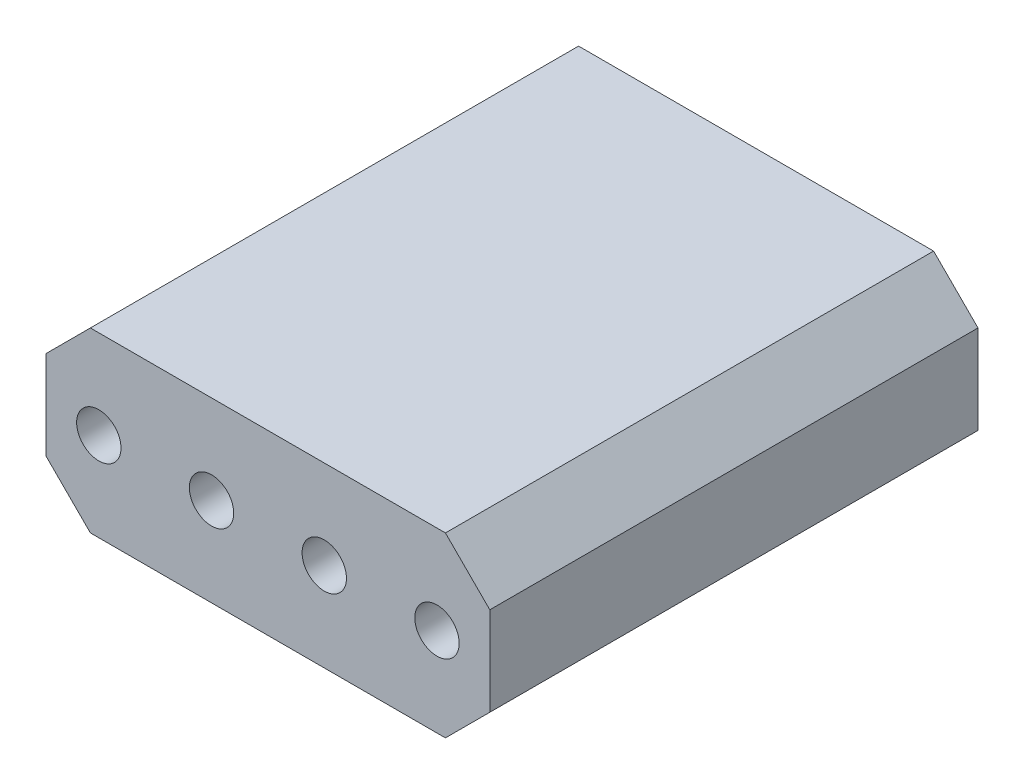
ISO-10303-21;
HEADER;
FILE_DESCRIPTION(('STEP AP214'),'2;1');
FILE_NAME('part.step','',(''),(''),'','','');
FILE_SCHEMA(('AUTOMOTIVE_DESIGN { 1 0 10303 214 1 1 1 1 }'));
ENDSEC;
DATA;
#1=APPLICATION_CONTEXT('core data for automotive mechanical design processes');
#2=APPLICATION_PROTOCOL_DEFINITION('international standard','automotive_design',2000,#1);
#3=PRODUCT_CONTEXT('',#1,'mechanical');
#4=PRODUCT('Part','Part','',(#3));
#5=PRODUCT_RELATED_PRODUCT_CATEGORY('part','',(#4));
#6=PRODUCT_DEFINITION_FORMATION('','',#4);
#7=PRODUCT_DEFINITION_CONTEXT('part definition',#1,'design');
#8=PRODUCT_DEFINITION('design','',#6,#7);
#9=PRODUCT_DEFINITION_SHAPE('','',#8);
#10=(LENGTH_UNIT() NAMED_UNIT(*) SI_UNIT(.MILLI.,.METRE.));
#11=(NAMED_UNIT(*) PLANE_ANGLE_UNIT() SI_UNIT($,.RADIAN.));
#12=(NAMED_UNIT(*) SI_UNIT($,.STERADIAN.) SOLID_ANGLE_UNIT());
#13=UNCERTAINTY_MEASURE_WITH_UNIT(LENGTH_MEASURE(1.E-05),#10,'distance_accuracy_value','');
#14=(GEOMETRIC_REPRESENTATION_CONTEXT(3) GLOBAL_UNCERTAINTY_ASSIGNED_CONTEXT((#13)) GLOBAL_UNIT_ASSIGNED_CONTEXT((#10,
#11,#12)) REPRESENTATION_CONTEXT('',''));
#15=CARTESIAN_POINT('',(0.,0.,0.));
#16=DIRECTION('',(0.,0.,1.));
#17=DIRECTION('',(1.,0.,0.));
#18=AXIS2_PLACEMENT_3D('',#15,#16,#17);
#19=CARTESIAN_POINT('',(0.,0.,8.));
#20=DIRECTION('',(0.,0.,-1.));
#21=DIRECTION('',(-1.,0.,0.));
#22=AXIS2_PLACEMENT_3D('',#19,#20,#21);
#23=PLANE('',#22);
#24=DIRECTION('',(-1.,0.,0.));
#25=VECTOR('',#24,1.);
#26=CARTESIAN_POINT('',(0.920000000000031,0.350000000000003,8.));
#27=LINE('',#26,#25);
#28=CARTESIAN_POINT('',(1.62000000000003,0.350000000000003,8.));
#29=VERTEX_POINT('',#28);
#30=CARTESIAN_POINT('',(0.920000000000031,0.350000000000003,8.));
#31=VERTEX_POINT('',#30);
#32=EDGE_CURVE('E198',#29,#31,#27,.T.);
#33=ORIENTED_EDGE('',*,*,#32,.F.);
#34=DIRECTION('',(0.,1.,0.));
#35=VECTOR('',#34,1.);
#36=CARTESIAN_POINT('',(1.62000000000003,0.350000000000003,8.));
#37=LINE('',#36,#35);
#38=CARTESIAN_POINT('',(1.62000000000003,-0.350000000000003,8.));
#39=VERTEX_POINT('',#38);
#40=EDGE_CURVE('E224',#39,#29,#37,.T.);
#41=ORIENTED_EDGE('',*,*,#40,.F.);
#42=DIRECTION('',(1.,0.,0.));
#43=VECTOR('',#42,1.);
#44=CARTESIAN_POINT('',(0.920000000000031,-0.350000000000003,8.));
#45=LINE('',#44,#43);
#46=CARTESIAN_POINT('',(0.920000000000031,-0.350000000000003,8.));
#47=VERTEX_POINT('',#46);
#48=EDGE_CURVE('E222',#47,#39,#45,.T.);
#49=ORIENTED_EDGE('',*,*,#48,.F.);
#50=DIRECTION('',(0.,-1.,0.));
#51=VECTOR('',#50,1.);
#52=CARTESIAN_POINT('',(0.920000000000031,0.350000000000003,8.));
#53=LINE('',#52,#51);
#54=EDGE_CURVE('E208',#31,#47,#53,.T.);
#55=ORIENTED_EDGE('',*,*,#54,.F.);
#56=EDGE_LOOP('',(#33,#41,#49,#55));
#57=FACE_BOUND('',#56,.T.);
#58=CARTESIAN_POINT('',(1.27000000000003,0.,8.));
#59=DIRECTION('',(0.,0.,1.));
#60=DIRECTION('',(1.,0.,0.));
#61=AXIS2_PLACEMENT_3D('',#58,#59,#60);
#62=CIRCLE('',#61,0.5);
#63=CARTESIAN_POINT('',(1.77000000000003,0.,8.));
#64=VERTEX_POINT('',#63);
#65=EDGE_CURVE('E414',#64,#64,#62,.T.);
#66=ORIENTED_EDGE('',*,*,#65,.T.);
#67=EDGE_LOOP('',(#66));
#68=FACE_BOUND('',#67,.T.);
#69=ADVANCED_FACE('F35',(#57,#68),#23,.F.);
#70=DIRECTION('',(1.,0.,0.));
#71=VECTOR('',#70,1.);
#72=CARTESIAN_POINT('',(-4.15999999999997,-0.350000000000003,8.));
#73=LINE('',#72,#71);
#74=CARTESIAN_POINT('',(-4.15999999999997,-0.350000000000003,8.));
#75=VERTEX_POINT('',#74);
#76=CARTESIAN_POINT('',(-3.45999999999997,-0.350000000000003,8.));
#77=VERTEX_POINT('',#76);
#78=EDGE_CURVE('E273',#75,#77,#73,.T.);
#79=ORIENTED_EDGE('',*,*,#78,.F.);
#80=DIRECTION('',(0.,-1.,0.));
#81=VECTOR('',#80,1.);
#82=CARTESIAN_POINT('',(-4.15999999999997,-0.350000000000003,8.));
#83=LINE('',#82,#81);
#84=CARTESIAN_POINT('',(-4.15999999999997,0.350000000000003,8.));
#85=VERTEX_POINT('',#84);
#86=EDGE_CURVE('E281',#85,#75,#83,.T.);
#87=ORIENTED_EDGE('',*,*,#86,.F.);
#88=DIRECTION('',(-1.,0.,0.));
#89=VECTOR('',#88,1.);
#90=CARTESIAN_POINT('',(-4.15999999999997,0.350000000000003,8.));
#91=LINE('',#90,#89);
#92=CARTESIAN_POINT('',(-3.45999999999997,0.350000000000003,8.));
#93=VERTEX_POINT('',#92);
#94=EDGE_CURVE('E278',#93,#85,#91,.T.);
#95=ORIENTED_EDGE('',*,*,#94,.F.);
#96=DIRECTION('',(0.,1.,0.));
#97=VECTOR('',#96,1.);
#98=CARTESIAN_POINT('',(-3.45999999999997,0.350000000000003,8.));
#99=LINE('',#98,#97);
#100=EDGE_CURVE('E275',#77,#93,#99,.T.);
#101=ORIENTED_EDGE('',*,*,#100,.F.);
#102=EDGE_LOOP('',(#79,#87,#95,#101));
#103=FACE_BOUND('',#102,.T.);
#104=CARTESIAN_POINT('',(-3.80999999999997,0.,8.));
#105=DIRECTION('',(0.,0.,1.));
#106=DIRECTION('',(1.,0.,0.));
#107=AXIS2_PLACEMENT_3D('',#104,#105,#106);
#108=CIRCLE('',#107,0.5);
#109=CARTESIAN_POINT('',(-3.30999999999997,0.,8.));
#110=VERTEX_POINT('',#109);
#111=EDGE_CURVE('E402',#110,#110,#108,.T.);
#112=ORIENTED_EDGE('',*,*,#111,.T.);
#113=EDGE_LOOP('',(#112));
#114=FACE_BOUND('',#113,.T.);
#115=ADVANCED_FACE('F446',(#103,#114),#23,.F.);
#116=DIRECTION('',(-1.,0.,0.));
#117=VECTOR('',#116,1.);
#118=CARTESIAN_POINT('',(-1.61999999999997,0.350000000000003,8.));
#119=LINE('',#118,#117);
#120=CARTESIAN_POINT('',(-0.919999999999969,0.350000000000003,8.));
#121=VERTEX_POINT('',#120);
#122=CARTESIAN_POINT('',(-1.61999999999997,0.350000000000003,8.));
#123=VERTEX_POINT('',#122);
#124=EDGE_CURVE('E242',#121,#123,#119,.T.);
#125=ORIENTED_EDGE('',*,*,#124,.F.);
#126=DIRECTION('',(0.,1.,0.));
#127=VECTOR('',#126,1.);
#128=CARTESIAN_POINT('',(-0.919999999999969,0.350000000000003,8.));
#129=LINE('',#128,#127);
#130=CARTESIAN_POINT('',(-0.919999999999969,-0.350000000000003,8.));
#131=VERTEX_POINT('',#130);
#132=EDGE_CURVE('E250',#131,#121,#129,.T.);
#133=ORIENTED_EDGE('',*,*,#132,.F.);
#134=DIRECTION('',(1.,0.,0.));
#135=VECTOR('',#134,1.);
#136=CARTESIAN_POINT('',(-1.61999999999997,-0.350000000000003,8.));
#137=LINE('',#136,#135);
#138=CARTESIAN_POINT('',(-1.61999999999997,-0.350000000000003,8.));
#139=VERTEX_POINT('',#138);
#140=EDGE_CURVE('E247',#139,#131,#137,.T.);
#141=ORIENTED_EDGE('',*,*,#140,.F.);
#142=DIRECTION('',(0.,-1.,0.));
#143=VECTOR('',#142,1.);
#144=CARTESIAN_POINT('',(-1.61999999999997,0.350000000000003,8.));
#145=LINE('',#144,#143);
#146=EDGE_CURVE('E244',#123,#139,#145,.T.);
#147=ORIENTED_EDGE('',*,*,#146,.F.);
#148=EDGE_LOOP('',(#125,#133,#141,#147));
#149=FACE_BOUND('',#148,.T.);
#150=CARTESIAN_POINT('',(-1.26999999999997,0.,8.));
#151=DIRECTION('',(0.,0.,1.));
#152=DIRECTION('',(1.,0.,0.));
#153=AXIS2_PLACEMENT_3D('',#150,#151,#152);
#154=CIRCLE('',#153,0.5);
#155=CARTESIAN_POINT('',(-0.769999999999969,0.,8.));
#156=VERTEX_POINT('',#155);
#157=EDGE_CURVE('E408',#156,#156,#154,.T.);
#158=ORIENTED_EDGE('',*,*,#157,.T.);
#159=EDGE_LOOP('',(#158));
#160=FACE_BOUND('',#159,.T.);
#161=ADVANCED_FACE('F452',(#149,#160),#23,.F.);
#162=DIRECTION('',(-1.,0.,0.));
#163=VECTOR('',#162,1.);
#164=CARTESIAN_POINT('',(3.46000000000003,0.350000000000003,8.));
#165=LINE('',#164,#163);
#166=CARTESIAN_POINT('',(4.16000000000003,0.350000000000003,8.));
#167=VERTEX_POINT('',#166);
#168=CARTESIAN_POINT('',(3.46000000000003,0.350000000000003,8.));
#169=VERTEX_POINT('',#168);
#170=EDGE_CURVE('E304',#167,#169,#165,.T.);
#171=ORIENTED_EDGE('',*,*,#170,.F.);
#172=DIRECTION('',(0.,1.,0.));
#173=VECTOR('',#172,1.);
#174=CARTESIAN_POINT('',(4.16000000000003,-0.350000000000008,8.));
#175=LINE('',#174,#173);
#176=CARTESIAN_POINT('',(4.16000000000003,-0.350000000000008,8.));
#177=VERTEX_POINT('',#176);
#178=EDGE_CURVE('E312',#177,#167,#175,.T.);
#179=ORIENTED_EDGE('',*,*,#178,.F.);
#180=DIRECTION('',(1.,0.,0.));
#181=VECTOR('',#180,1.);
#182=CARTESIAN_POINT('',(4.16000000000003,-0.350000000000008,8.));
#183=LINE('',#182,#181);
#184=CARTESIAN_POINT('',(3.46000000000003,-0.350000000000003,8.));
#185=VERTEX_POINT('',#184);
#186=EDGE_CURVE('E309',#185,#177,#183,.T.);
#187=ORIENTED_EDGE('',*,*,#186,.F.);
#188=DIRECTION('',(0.,-1.,0.));
#189=VECTOR('',#188,1.);
#190=CARTESIAN_POINT('',(3.46000000000003,0.350000000000003,8.));
#191=LINE('',#190,#189);
#192=EDGE_CURVE('E306',#169,#185,#191,.T.);
#193=ORIENTED_EDGE('',*,*,#192,.F.);
#194=EDGE_LOOP('',(#171,#179,#187,#193));
#195=FACE_BOUND('',#194,.T.);
#196=CARTESIAN_POINT('',(3.81000000000003,0.,8.));
#197=DIRECTION('',(0.,0.,1.));
#198=DIRECTION('',(1.,0.,0.));
#199=AXIS2_PLACEMENT_3D('',#196,#197,#198);
#200=CIRCLE('',#199,0.5);
#201=CARTESIAN_POINT('',(4.31000000000003,0.,8.));
#202=VERTEX_POINT('',#201);
#203=EDGE_CURVE('E420',#202,#202,#200,.T.);
#204=ORIENTED_EDGE('',*,*,#203,.T.);
#205=EDGE_LOOP('',(#204));
#206=FACE_BOUND('',#205,.T.);
#207=ADVANCED_FACE('F448',(#195,#206),#23,.F.);
#208=CARTESIAN_POINT('',(0.,0.,0.));
#209=DIRECTION('',(0.,0.,-1.));
#210=DIRECTION('',(-1.,0.,0.));
#211=AXIS2_PLACEMENT_3D('',#208,#209,#210);
#212=PLANE('',#211);
#213=DIRECTION('',(-1.,0.,0.));
#214=VECTOR('',#213,1.);
#215=CARTESIAN_POINT('',(-4.99999999999997,2.,0.));
#216=LINE('',#215,#214);
#217=CARTESIAN_POINT('',(4.00000000000003,2.,0.));
#218=VERTEX_POINT('',#217);
#219=CARTESIAN_POINT('',(-3.99999999999997,2.,0.));
#220=VERTEX_POINT('',#219);
#221=EDGE_CURVE('E337',#218,#220,#216,.T.);
#222=ORIENTED_EDGE('',*,*,#221,.F.);
#223=DIRECTION('',(-0.707106781186546,0.707106781186549,0.));
#224=VECTOR('',#223,1.);
#225=CARTESIAN_POINT('',(3.00000000000002,3.00000000000001,0.));
#226=LINE('',#225,#224);
#227=CARTESIAN_POINT('',(5.00000000000003,0.999999999999997,0.));
#228=VERTEX_POINT('',#227);
#229=EDGE_CURVE('E356',#218,#228,#226,.F.);
#230=ORIENTED_EDGE('',*,*,#229,.T.);
#231=DIRECTION('',(0.,1.,0.));
#232=VECTOR('',#231,1.);
#233=CARTESIAN_POINT('',(5.00000000000003,-2.,0.));
#234=LINE('',#233,#232);
#235=CARTESIAN_POINT('',(5.00000000000003,-1.,0.));
#236=VERTEX_POINT('',#235);
#237=EDGE_CURVE('E334',#236,#228,#234,.T.);
#238=ORIENTED_EDGE('',*,*,#237,.F.);
#239=DIRECTION('',(0.707106781186549,0.707106781186546,0.));
#240=VECTOR('',#239,1.);
#241=CARTESIAN_POINT('',(3.00000000000001,-3.00000000000002,0.));
#242=LINE('',#241,#240);
#243=CARTESIAN_POINT('',(4.00000000000003,-2.,0.));
#244=VERTEX_POINT('',#243);
#245=EDGE_CURVE('E354',#236,#244,#242,.F.);
#246=ORIENTED_EDGE('',*,*,#245,.T.);
#247=DIRECTION('',(1.,0.,0.));
#248=VECTOR('',#247,1.);
#249=CARTESIAN_POINT('',(-4.99999999999997,-2.,0.));
#250=LINE('',#249,#248);
#251=CARTESIAN_POINT('',(-3.99999999999997,-2.,0.));
#252=VERTEX_POINT('',#251);
#253=EDGE_CURVE('E343',#252,#244,#250,.T.);
#254=ORIENTED_EDGE('',*,*,#253,.F.);
#255=DIRECTION('',(0.707106781186546,-0.707106781186549,0.));
#256=VECTOR('',#255,1.);
#257=CARTESIAN_POINT('',(-2.99999999999999,-2.99999999999998,0.));
#258=LINE('',#257,#256);
#259=CARTESIAN_POINT('',(-4.99999999999997,-0.999999999999997,0.));
#260=VERTEX_POINT('',#259);
#261=EDGE_CURVE('E352',#252,#260,#258,.F.);
#262=ORIENTED_EDGE('',*,*,#261,.T.);
#263=DIRECTION('',(0.,-1.,0.));
#264=VECTOR('',#263,1.);
#265=CARTESIAN_POINT('',(-4.99999999999997,-2.,0.));
#266=LINE('',#265,#264);
#267=CARTESIAN_POINT('',(-4.99999999999997,1.,0.));
#268=VERTEX_POINT('',#267);
#269=EDGE_CURVE('E340',#268,#260,#266,.T.);
#270=ORIENTED_EDGE('',*,*,#269,.F.);
#271=DIRECTION('',(-0.707106781186549,-0.707106781186546,0.));
#272=VECTOR('',#271,1.);
#273=CARTESIAN_POINT('',(-2.99999999999998,2.99999999999999,0.));
#274=LINE('',#273,#272);
#275=EDGE_CURVE('E350',#268,#220,#274,.F.);
#276=ORIENTED_EDGE('',*,*,#275,.T.);
#277=EDGE_LOOP('',(#222,#230,#238,#246,#254,#262,#270,#276));
#278=FACE_BOUND('',#277,.T.);
#279=DIRECTION('',(0.,1.,0.));
#280=VECTOR('',#279,1.);
#281=CARTESIAN_POINT('',(4.16000000000003,-0.350000000000008,0.));
#282=LINE('',#281,#280);
#283=CARTESIAN_POINT('',(4.16000000000003,-0.350000000000008,0.));
#284=VERTEX_POINT('',#283);
#285=CARTESIAN_POINT('',(4.16000000000003,0.350000000000003,0.));
#286=VERTEX_POINT('',#285);
#287=EDGE_CURVE('E307',#284,#286,#282,.T.);
#288=ORIENTED_EDGE('',*,*,#287,.T.);
#289=DIRECTION('',(-1.,0.,0.));
#290=VECTOR('',#289,1.);
#291=CARTESIAN_POINT('',(3.46000000000003,0.350000000000003,0.));
#292=LINE('',#291,#290);
#293=CARTESIAN_POINT('',(3.46000000000003,0.350000000000003,0.));
#294=VERTEX_POINT('',#293);
#295=EDGE_CURVE('E303',#286,#294,#292,.T.);
#296=ORIENTED_EDGE('',*,*,#295,.T.);
#297=DIRECTION('',(0.,-1.,0.));
#298=VECTOR('',#297,1.);
#299=CARTESIAN_POINT('',(3.46000000000003,0.350000000000003,0.));
#300=LINE('',#299,#298);
#301=CARTESIAN_POINT('',(3.46000000000003,-0.350000000000003,0.));
#302=VERTEX_POINT('',#301);
#303=EDGE_CURVE('E317',#294,#302,#300,.T.);
#304=ORIENTED_EDGE('',*,*,#303,.T.);
#305=DIRECTION('',(1.,0.,0.));
#306=VECTOR('',#305,1.);
#307=CARTESIAN_POINT('',(4.16000000000003,-0.350000000000008,0.));
#308=LINE('',#307,#306);
#309=EDGE_CURVE('E320',#302,#284,#308,.T.);
#310=ORIENTED_EDGE('',*,*,#309,.T.);
#311=EDGE_LOOP('',(#288,#296,#304,#310));
#312=FACE_BOUND('',#311,.T.);
#313=DIRECTION('',(0.,-1.,0.));
#314=VECTOR('',#313,1.);
#315=CARTESIAN_POINT('',(-4.15999999999997,-0.350000000000003,0.));
#316=LINE('',#315,#314);
#317=CARTESIAN_POINT('',(-4.15999999999997,0.350000000000003,0.));
#318=VERTEX_POINT('',#317);
#319=CARTESIAN_POINT('',(-4.15999999999997,-0.350000000000003,0.));
#320=VERTEX_POINT('',#319);
#321=EDGE_CURVE('E276',#318,#320,#316,.T.);
#322=ORIENTED_EDGE('',*,*,#321,.T.);
#323=DIRECTION('',(1.,0.,0.));
#324=VECTOR('',#323,1.);
#325=CARTESIAN_POINT('',(-4.15999999999997,-0.350000000000003,0.));
#326=LINE('',#325,#324);
#327=CARTESIAN_POINT('',(-3.45999999999997,-0.350000000000003,0.));
#328=VERTEX_POINT('',#327);
#329=EDGE_CURVE('E272',#320,#328,#326,.T.);
#330=ORIENTED_EDGE('',*,*,#329,.T.);
#331=DIRECTION('',(0.,1.,0.));
#332=VECTOR('',#331,1.);
#333=CARTESIAN_POINT('',(-3.45999999999997,0.350000000000003,0.));
#334=LINE('',#333,#332);
#335=CARTESIAN_POINT('',(-3.45999999999997,0.350000000000003,0.));
#336=VERTEX_POINT('',#335);
#337=EDGE_CURVE('E286',#328,#336,#334,.T.);
#338=ORIENTED_EDGE('',*,*,#337,.T.);
#339=DIRECTION('',(-1.,0.,0.));
#340=VECTOR('',#339,1.);
#341=CARTESIAN_POINT('',(-4.15999999999997,0.350000000000003,0.));
#342=LINE('',#341,#340);
#343=EDGE_CURVE('E289',#336,#318,#342,.T.);
#344=ORIENTED_EDGE('',*,*,#343,.T.);
#345=EDGE_LOOP('',(#322,#330,#338,#344));
#346=FACE_BOUND('',#345,.T.);
#347=DIRECTION('',(0.,1.,0.));
#348=VECTOR('',#347,1.);
#349=CARTESIAN_POINT('',(-0.919999999999969,0.350000000000003,0.));
#350=LINE('',#349,#348);
#351=CARTESIAN_POINT('',(-0.919999999999969,-0.350000000000003,0.));
#352=VERTEX_POINT('',#351);
#353=CARTESIAN_POINT('',(-0.919999999999969,0.350000000000003,0.));
#354=VERTEX_POINT('',#353);
#355=EDGE_CURVE('E245',#352,#354,#350,.T.);
#356=ORIENTED_EDGE('',*,*,#355,.T.);
#357=DIRECTION('',(-1.,0.,0.));
#358=VECTOR('',#357,1.);
#359=CARTESIAN_POINT('',(-1.61999999999997,0.350000000000003,0.));
#360=LINE('',#359,#358);
#361=CARTESIAN_POINT('',(-1.61999999999997,0.350000000000003,0.));
#362=VERTEX_POINT('',#361);
#363=EDGE_CURVE('E216',#354,#362,#360,.T.);
#364=ORIENTED_EDGE('',*,*,#363,.T.);
#365=DIRECTION('',(0.,-1.,0.));
#366=VECTOR('',#365,1.);
#367=CARTESIAN_POINT('',(-1.61999999999997,0.350000000000003,0.));
#368=LINE('',#367,#366);
#369=CARTESIAN_POINT('',(-1.61999999999997,-0.350000000000003,0.));
#370=VERTEX_POINT('',#369);
#371=EDGE_CURVE('E255',#362,#370,#368,.T.);
#372=ORIENTED_EDGE('',*,*,#371,.T.);
#373=DIRECTION('',(1.,0.,0.));
#374=VECTOR('',#373,1.);
#375=CARTESIAN_POINT('',(-1.61999999999997,-0.350000000000003,0.));
#376=LINE('',#375,#374);
#377=EDGE_CURVE('E258',#370,#352,#376,.T.);
#378=ORIENTED_EDGE('',*,*,#377,.T.);
#379=EDGE_LOOP('',(#356,#364,#372,#378));
#380=FACE_BOUND('',#379,.T.);
#381=DIRECTION('',(0.,1.,0.));
#382=VECTOR('',#381,1.);
#383=CARTESIAN_POINT('',(1.62000000000003,0.350000000000003,0.));
#384=LINE('',#383,#382);
#385=CARTESIAN_POINT('',(1.62000000000003,-0.350000000000003,0.));
#386=VERTEX_POINT('',#385);
#387=CARTESIAN_POINT('',(1.62000000000003,0.350000000000003,0.));
#388=VERTEX_POINT('',#387);
#389=EDGE_CURVE('E209',#386,#388,#384,.T.);
#390=ORIENTED_EDGE('',*,*,#389,.T.);
#391=DIRECTION('',(-1.,0.,0.));
#392=VECTOR('',#391,1.);
#393=CARTESIAN_POINT('',(0.920000000000031,0.350000000000003,0.));
#394=LINE('',#393,#392);
#395=CARTESIAN_POINT('',(0.920000000000031,0.350000000000003,0.));
#396=VERTEX_POINT('',#395);
#397=EDGE_CURVE('E229',#388,#396,#394,.T.);
#398=ORIENTED_EDGE('',*,*,#397,.T.);
#399=DIRECTION('',(0.,-1.,0.));
#400=VECTOR('',#399,1.);
#401=CARTESIAN_POINT('',(0.920000000000031,0.350000000000003,0.));
#402=LINE('',#401,#400);
#403=CARTESIAN_POINT('',(0.920000000000031,-0.350000000000003,0.));
#404=VERTEX_POINT('',#403);
#405=EDGE_CURVE('E215',#396,#404,#402,.T.);
#406=ORIENTED_EDGE('',*,*,#405,.T.);
#407=DIRECTION('',(1.,0.,0.));
#408=VECTOR('',#407,1.);
#409=CARTESIAN_POINT('',(0.920000000000031,-0.350000000000003,0.));
#410=LINE('',#409,#408);
#411=EDGE_CURVE('E233',#404,#386,#410,.T.);
#412=ORIENTED_EDGE('',*,*,#411,.T.);
#413=EDGE_LOOP('',(#390,#398,#406,#412));
#414=FACE_BOUND('',#413,.T.);
#415=ADVANCED_FACE('F385',(#278,#312,#346,#380,#414),#212,.T.);
#416=CARTESIAN_POINT('',(5.00000000000003,-2.,8.));
#417=DIRECTION('',(-1.,0.,0.));
#418=DIRECTION('',(0.,0.,1.));
#419=AXIS2_PLACEMENT_3D('',#416,#417,#418);
#420=PLANE('',#419);
#421=ORIENTED_EDGE('',*,*,#237,.T.);
#422=DIRECTION('',(0.,0.,1.));
#423=VECTOR('',#422,1.);
#424=CARTESIAN_POINT('',(5.00000000000003,0.999999999999997,8.));
#425=LINE('',#424,#423);
#426=CARTESIAN_POINT('',(5.00000000000003,0.999999999999997,11.));
#427=VERTEX_POINT('',#426);
#428=EDGE_CURVE('E361',#228,#427,#425,.T.);
#429=ORIENTED_EDGE('',*,*,#428,.T.);
#430=DIRECTION('',(0.,1.,0.));
#431=VECTOR('',#430,1.);
#432=CARTESIAN_POINT('',(5.00000000000003,-2.,11.));
#433=LINE('',#432,#431);
#434=CARTESIAN_POINT('',(5.00000000000003,-1.,11.));
#435=VERTEX_POINT('',#434);
#436=EDGE_CURVE('E398',#435,#427,#433,.T.);
#437=ORIENTED_EDGE('',*,*,#436,.F.);
#438=DIRECTION('',(0.,0.,-1.));
#439=VECTOR('',#438,1.);
#440=CARTESIAN_POINT('',(5.00000000000003,-1.,8.));
#441=LINE('',#440,#439);
#442=EDGE_CURVE('E358',#435,#236,#441,.T.);
#443=ORIENTED_EDGE('',*,*,#442,.T.);
#444=EDGE_LOOP('',(#421,#429,#437,#443));
#445=FACE_BOUND('',#444,.T.);
#446=ADVANCED_FACE('F462',(#445),#420,.F.);
#447=CARTESIAN_POINT('',(-4.99999999999997,2.,8.));
#448=DIRECTION('',(0.,-1.,0.));
#449=DIRECTION('',(0.,0.,-1.));
#450=AXIS2_PLACEMENT_3D('',#447,#448,#449);
#451=PLANE('',#450);
#452=DIRECTION('',(-1.,0.,0.));
#453=VECTOR('',#452,1.);
#454=CARTESIAN_POINT('',(-5.00000000000003,2.,11.));
#455=LINE('',#454,#453);
#456=CARTESIAN_POINT('',(4.00000000000003,2.,11.));
#457=VERTEX_POINT('',#456);
#458=CARTESIAN_POINT('',(-3.99999999999997,2.,11.));
#459=VERTEX_POINT('',#458);
#460=EDGE_CURVE('E393',#457,#459,#455,.T.);
#461=ORIENTED_EDGE('',*,*,#460,.F.);
#462=DIRECTION('',(0.,0.,-1.));
#463=VECTOR('',#462,1.);
#464=CARTESIAN_POINT('',(4.00000000000003,2.,8.));
#465=LINE('',#464,#463);
#466=EDGE_CURVE('E347',#457,#218,#465,.T.);
#467=ORIENTED_EDGE('',*,*,#466,.T.);
#468=ORIENTED_EDGE('',*,*,#221,.T.);
#469=DIRECTION('',(0.,0.,1.));
#470=VECTOR('',#469,1.);
#471=CARTESIAN_POINT('',(-3.99999999999997,2.,8.));
#472=LINE('',#471,#470);
#473=EDGE_CURVE('E345',#220,#459,#472,.T.);
#474=ORIENTED_EDGE('',*,*,#473,.T.);
#475=EDGE_LOOP('',(#461,#467,#468,#474));
#476=FACE_BOUND('',#475,.T.);
#477=ADVANCED_FACE('F523',(#476),#451,.F.);
#478=CARTESIAN_POINT('',(-4.99999999999997,-2.,8.));
#479=DIRECTION('',(1.,0.,0.));
#480=DIRECTION('',(0.,0.,-1.));
#481=AXIS2_PLACEMENT_3D('',#478,#479,#480);
#482=PLANE('',#481);
#483=ORIENTED_EDGE('',*,*,#269,.T.);
#484=DIRECTION('',(0.,0.,1.));
#485=VECTOR('',#484,1.);
#486=CARTESIAN_POINT('',(-4.99999999999997,-0.999999999999997,8.));
#487=LINE('',#486,#485);
#488=CARTESIAN_POINT('',(-5.00000000000003,-0.999999999999997,11.));
#489=VERTEX_POINT('',#488);
#490=EDGE_CURVE('E11',#260,#489,#487,.T.);
#491=ORIENTED_EDGE('',*,*,#490,.T.);
#492=DIRECTION('',(0.,-1.,0.));
#493=VECTOR('',#492,1.);
#494=CARTESIAN_POINT('',(-5.00000000000003,-2.,11.));
#495=LINE('',#494,#493);
#496=CARTESIAN_POINT('',(-5.00000000000003,1.,11.));
#497=VERTEX_POINT('',#496);
#498=EDGE_CURVE('E380',#497,#489,#495,.T.);
#499=ORIENTED_EDGE('',*,*,#498,.F.);
#500=DIRECTION('',(0.,0.,-1.));
#501=VECTOR('',#500,1.);
#502=CARTESIAN_POINT('',(-4.99999999999997,1.,8.));
#503=LINE('',#502,#501);
#504=EDGE_CURVE('E43',#497,#268,#503,.T.);
#505=ORIENTED_EDGE('',*,*,#504,.T.);
#506=EDGE_LOOP('',(#483,#491,#499,#505));
#507=FACE_BOUND('',#506,.T.);
#508=ADVANCED_FACE('F378',(#507),#482,.F.);
#509=CARTESIAN_POINT('',(-4.99999999999997,-2.,8.));
#510=DIRECTION('',(0.,1.,0.));
#511=DIRECTION('',(0.,0.,1.));
#512=AXIS2_PLACEMENT_3D('',#509,#510,#511);
#513=PLANE('',#512);
#514=ORIENTED_EDGE('',*,*,#253,.T.);
#515=DIRECTION('',(0.,0.,1.));
#516=VECTOR('',#515,1.);
#517=CARTESIAN_POINT('',(4.00000000000003,-2.,8.));
#518=LINE('',#517,#516);
#519=CARTESIAN_POINT('',(4.00000000000003,-2.,11.));
#520=VERTEX_POINT('',#519);
#521=EDGE_CURVE('E50',#244,#520,#518,.T.);
#522=ORIENTED_EDGE('',*,*,#521,.T.);
#523=DIRECTION('',(1.,0.,0.));
#524=VECTOR('',#523,1.);
#525=CARTESIAN_POINT('',(-5.00000000000003,-2.,11.));
#526=LINE('',#525,#524);
#527=CARTESIAN_POINT('',(-3.99999999999997,-2.,11.));
#528=VERTEX_POINT('',#527);
#529=EDGE_CURVE('E231',#528,#520,#526,.T.);
#530=ORIENTED_EDGE('',*,*,#529,.F.);
#531=DIRECTION('',(0.,0.,-1.));
#532=VECTOR('',#531,1.);
#533=CARTESIAN_POINT('',(-3.99999999999997,-2.,8.));
#534=LINE('',#533,#532);
#535=EDGE_CURVE('E370',#528,#252,#534,.T.);
#536=ORIENTED_EDGE('',*,*,#535,.T.);
#537=EDGE_LOOP('',(#514,#522,#530,#536));
#538=FACE_BOUND('',#537,.T.);
#539=ADVANCED_FACE('F391',(#538),#513,.F.);
#540=CARTESIAN_POINT('',(3.46000000000003,0.350000000000003,8.));
#541=DIRECTION('',(0.,-1.,0.));
#542=DIRECTION('',(0.,0.,-1.));
#543=AXIS2_PLACEMENT_3D('',#540,#541,#542);
#544=PLANE('',#543);
#545=ORIENTED_EDGE('',*,*,#295,.F.);
#546=DIRECTION('',(0.,0.,-1.));
#547=VECTOR('',#546,1.);
#548=CARTESIAN_POINT('',(4.16000000000003,0.350000000000003,8.));
#549=LINE('',#548,#547);
#550=EDGE_CURVE('E314',#167,#286,#549,.T.);
#551=ORIENTED_EDGE('',*,*,#550,.F.);
#552=ORIENTED_EDGE('',*,*,#170,.T.);
#553=DIRECTION('',(0.,0.,-1.));
#554=VECTOR('',#553,1.);
#555=CARTESIAN_POINT('',(3.46000000000003,0.350000000000003,8.));
#556=LINE('',#555,#554);
#557=EDGE_CURVE('E331',#169,#294,#556,.T.);
#558=ORIENTED_EDGE('',*,*,#557,.T.);
#559=EDGE_LOOP('',(#545,#551,#552,#558));
#560=FACE_BOUND('',#559,.T.);
#561=ADVANCED_FACE('F552',(#560),#544,.T.);
#562=CARTESIAN_POINT('',(3.46000000000003,0.350000000000003,8.));
#563=DIRECTION('',(1.,0.,0.));
#564=DIRECTION('',(0.,0.,-1.));
#565=AXIS2_PLACEMENT_3D('',#562,#563,#564);
#566=PLANE('',#565);
#567=ORIENTED_EDGE('',*,*,#303,.F.);
#568=ORIENTED_EDGE('',*,*,#557,.F.);
#569=ORIENTED_EDGE('',*,*,#192,.T.);
#570=DIRECTION('',(0.,0.,-1.));
#571=VECTOR('',#570,1.);
#572=CARTESIAN_POINT('',(3.46000000000003,-0.350000000000003,8.));
#573=LINE('',#572,#571);
#574=EDGE_CURVE('E329',#185,#302,#573,.T.);
#575=ORIENTED_EDGE('',*,*,#574,.T.);
#576=EDGE_LOOP('',(#567,#568,#569,#575));
#577=FACE_BOUND('',#576,.T.);
#578=ADVANCED_FACE('F751',(#577),#566,.T.);
#579=CARTESIAN_POINT('',(4.16000000000003,-0.350000000000008,8.));
#580=DIRECTION('',(0.,1.,0.));
#581=DIRECTION('',(-1.,0.,0.));
#582=AXIS2_PLACEMENT_3D('',#579,#580,#581);
#583=PLANE('',#582);
#584=ORIENTED_EDGE('',*,*,#309,.F.);
#585=ORIENTED_EDGE('',*,*,#574,.F.);
#586=ORIENTED_EDGE('',*,*,#186,.T.);
#587=DIRECTION('',(0.,0.,-1.));
#588=VECTOR('',#587,1.);
#589=CARTESIAN_POINT('',(4.16000000000003,-0.350000000000008,8.));
#590=LINE('',#589,#588);
#591=EDGE_CURVE('E327',#177,#284,#590,.T.);
#592=ORIENTED_EDGE('',*,*,#591,.T.);
#593=EDGE_LOOP('',(#584,#585,#586,#592));
#594=FACE_BOUND('',#593,.T.);
#595=ADVANCED_FACE('F741',(#594),#583,.T.);
#596=CARTESIAN_POINT('',(4.16000000000003,-0.350000000000008,8.));
#597=DIRECTION('',(-1.,0.,0.));
#598=DIRECTION('',(0.,0.,1.));
#599=AXIS2_PLACEMENT_3D('',#596,#597,#598);
#600=PLANE('',#599);
#601=ORIENTED_EDGE('',*,*,#287,.F.);
#602=ORIENTED_EDGE('',*,*,#591,.F.);
#603=ORIENTED_EDGE('',*,*,#178,.T.);
#604=ORIENTED_EDGE('',*,*,#550,.T.);
#605=EDGE_LOOP('',(#601,#602,#603,#604));
#606=FACE_BOUND('',#605,.T.);
#607=ADVANCED_FACE('F731',(#606),#600,.T.);
#608=CARTESIAN_POINT('',(-4.15999999999997,-0.350000000000003,8.));
#609=DIRECTION('',(0.,1.,0.));
#610=DIRECTION('',(0.,0.,1.));
#611=AXIS2_PLACEMENT_3D('',#608,#609,#610);
#612=PLANE('',#611);
#613=ORIENTED_EDGE('',*,*,#329,.F.);
#614=DIRECTION('',(0.,0.,-1.));
#615=VECTOR('',#614,1.);
#616=CARTESIAN_POINT('',(-4.15999999999997,-0.350000000000003,8.));
#617=LINE('',#616,#615);
#618=EDGE_CURVE('E283',#75,#320,#617,.T.);
#619=ORIENTED_EDGE('',*,*,#618,.F.);
#620=ORIENTED_EDGE('',*,*,#78,.T.);
#621=DIRECTION('',(0.,0.,-1.));
#622=VECTOR('',#621,1.);
#623=CARTESIAN_POINT('',(-3.45999999999997,-0.350000000000003,8.));
#624=LINE('',#623,#622);
#625=EDGE_CURVE('E300',#77,#328,#624,.T.);
#626=ORIENTED_EDGE('',*,*,#625,.T.);
#627=EDGE_LOOP('',(#613,#619,#620,#626));
#628=FACE_BOUND('',#627,.T.);
#629=ADVANCED_FACE('F721',(#628),#612,.T.);
#630=CARTESIAN_POINT('',(-3.45999999999997,0.350000000000003,8.));
#631=DIRECTION('',(-1.,0.,0.));
#632=DIRECTION('',(0.,0.,1.));
#633=AXIS2_PLACEMENT_3D('',#630,#631,#632);
#634=PLANE('',#633);
#635=ORIENTED_EDGE('',*,*,#337,.F.);
#636=ORIENTED_EDGE('',*,*,#625,.F.);
#637=ORIENTED_EDGE('',*,*,#100,.T.);
#638=DIRECTION('',(0.,0.,-1.));
#639=VECTOR('',#638,1.);
#640=CARTESIAN_POINT('',(-3.45999999999997,0.350000000000003,8.));
#641=LINE('',#640,#639);
#642=EDGE_CURVE('E298',#93,#336,#641,.T.);
#643=ORIENTED_EDGE('',*,*,#642,.T.);
#644=EDGE_LOOP('',(#635,#636,#637,#643));
#645=FACE_BOUND('',#644,.T.);
#646=ADVANCED_FACE('F711',(#645),#634,.T.);
#647=CARTESIAN_POINT('',(-4.15999999999997,0.350000000000003,8.));
#648=DIRECTION('',(0.,-1.,0.));
#649=DIRECTION('',(0.,0.,-1.));
#650=AXIS2_PLACEMENT_3D('',#647,#648,#649);
#651=PLANE('',#650);
#652=ORIENTED_EDGE('',*,*,#343,.F.);
#653=ORIENTED_EDGE('',*,*,#642,.F.);
#654=ORIENTED_EDGE('',*,*,#94,.T.);
#655=DIRECTION('',(0.,0.,-1.));
#656=VECTOR('',#655,1.);
#657=CARTESIAN_POINT('',(-4.15999999999997,0.350000000000003,8.));
#658=LINE('',#657,#656);
#659=EDGE_CURVE('E296',#85,#318,#658,.T.);
#660=ORIENTED_EDGE('',*,*,#659,.T.);
#661=EDGE_LOOP('',(#652,#653,#654,#660));
#662=FACE_BOUND('',#661,.T.);
#663=ADVANCED_FACE('F701',(#662),#651,.T.);
#664=CARTESIAN_POINT('',(-4.15999999999997,-0.350000000000003,8.));
#665=DIRECTION('',(1.,0.,0.));
#666=DIRECTION('',(0.,0.,-1.));
#667=AXIS2_PLACEMENT_3D('',#664,#665,#666);
#668=PLANE('',#667);
#669=ORIENTED_EDGE('',*,*,#321,.F.);
#670=ORIENTED_EDGE('',*,*,#659,.F.);
#671=ORIENTED_EDGE('',*,*,#86,.T.);
#672=ORIENTED_EDGE('',*,*,#618,.T.);
#673=EDGE_LOOP('',(#669,#670,#671,#672));
#674=FACE_BOUND('',#673,.T.);
#675=ADVANCED_FACE('F691',(#674),#668,.T.);
#676=CARTESIAN_POINT('',(-1.61999999999997,0.350000000000003,8.));
#677=DIRECTION('',(0.,-1.,0.));
#678=DIRECTION('',(0.,0.,-1.));
#679=AXIS2_PLACEMENT_3D('',#676,#677,#678);
#680=PLANE('',#679);
#681=ORIENTED_EDGE('',*,*,#363,.F.);
#682=DIRECTION('',(0.,0.,-1.));
#683=VECTOR('',#682,1.);
#684=CARTESIAN_POINT('',(-0.919999999999969,0.350000000000003,8.));
#685=LINE('',#684,#683);
#686=EDGE_CURVE('E252',#121,#354,#685,.T.);
#687=ORIENTED_EDGE('',*,*,#686,.F.);
#688=ORIENTED_EDGE('',*,*,#124,.T.);
#689=DIRECTION('',(0.,0.,-1.));
#690=VECTOR('',#689,1.);
#691=CARTESIAN_POINT('',(-1.61999999999997,0.350000000000003,8.));
#692=LINE('',#691,#690);
#693=EDGE_CURVE('E269',#123,#362,#692,.T.);
#694=ORIENTED_EDGE('',*,*,#693,.T.);
#695=EDGE_LOOP('',(#681,#687,#688,#694));
#696=FACE_BOUND('',#695,.T.);
#697=ADVANCED_FACE('F681',(#696),#680,.T.);
#698=CARTESIAN_POINT('',(-1.61999999999997,0.350000000000003,8.));
#699=DIRECTION('',(1.,0.,0.));
#700=DIRECTION('',(0.,0.,-1.));
#701=AXIS2_PLACEMENT_3D('',#698,#699,#700);
#702=PLANE('',#701);
#703=ORIENTED_EDGE('',*,*,#371,.F.);
#704=ORIENTED_EDGE('',*,*,#693,.F.);
#705=ORIENTED_EDGE('',*,*,#146,.T.);
#706=DIRECTION('',(0.,0.,-1.));
#707=VECTOR('',#706,1.);
#708=CARTESIAN_POINT('',(-1.61999999999997,-0.350000000000003,8.));
#709=LINE('',#708,#707);
#710=EDGE_CURVE('E267',#139,#370,#709,.T.);
#711=ORIENTED_EDGE('',*,*,#710,.T.);
#712=EDGE_LOOP('',(#703,#704,#705,#711));
#713=FACE_BOUND('',#712,.T.);
#714=ADVANCED_FACE('F671',(#713),#702,.T.);
#715=CARTESIAN_POINT('',(-1.61999999999997,-0.350000000000003,8.));
#716=DIRECTION('',(0.,1.,0.));
#717=DIRECTION('',(0.,0.,1.));
#718=AXIS2_PLACEMENT_3D('',#715,#716,#717);
#719=PLANE('',#718);
#720=ORIENTED_EDGE('',*,*,#377,.F.);
#721=ORIENTED_EDGE('',*,*,#710,.F.);
#722=ORIENTED_EDGE('',*,*,#140,.T.);
#723=DIRECTION('',(0.,0.,-1.));
#724=VECTOR('',#723,1.);
#725=CARTESIAN_POINT('',(-0.919999999999969,-0.350000000000003,8.));
#726=LINE('',#725,#724);
#727=EDGE_CURVE('E265',#131,#352,#726,.T.);
#728=ORIENTED_EDGE('',*,*,#727,.T.);
#729=EDGE_LOOP('',(#720,#721,#722,#728));
#730=FACE_BOUND('',#729,.T.);
#731=ADVANCED_FACE('F661',(#730),#719,.T.);
#732=CARTESIAN_POINT('',(-0.919999999999969,0.350000000000003,8.));
#733=DIRECTION('',(-1.,0.,0.));
#734=DIRECTION('',(0.,0.,1.));
#735=AXIS2_PLACEMENT_3D('',#732,#733,#734);
#736=PLANE('',#735);
#737=ORIENTED_EDGE('',*,*,#355,.F.);
#738=ORIENTED_EDGE('',*,*,#727,.F.);
#739=ORIENTED_EDGE('',*,*,#132,.T.);
#740=ORIENTED_EDGE('',*,*,#686,.T.);
#741=EDGE_LOOP('',(#737,#738,#739,#740));
#742=FACE_BOUND('',#741,.T.);
#743=ADVANCED_FACE('F652',(#742),#736,.T.);
#744=CARTESIAN_POINT('',(0.920000000000031,0.350000000000003,8.));
#745=DIRECTION('',(0.,-1.,0.));
#746=DIRECTION('',(1.,0.,0.));
#747=AXIS2_PLACEMENT_3D('',#744,#745,#746);
#748=PLANE('',#747);
#749=ORIENTED_EDGE('',*,*,#397,.F.);
#750=DIRECTION('',(0.,0.,-1.));
#751=VECTOR('',#750,1.);
#752=CARTESIAN_POINT('',(1.62000000000003,0.350000000000003,8.));
#753=LINE('',#752,#751);
#754=EDGE_CURVE('E204',#29,#388,#753,.T.);
#755=ORIENTED_EDGE('',*,*,#754,.F.);
#756=ORIENTED_EDGE('',*,*,#32,.T.);
#757=DIRECTION('',(0.,0.,-1.));
#758=VECTOR('',#757,1.);
#759=CARTESIAN_POINT('',(0.920000000000031,0.350000000000003,8.));
#760=LINE('',#759,#758);
#761=EDGE_CURVE('E201',#31,#396,#760,.T.);
#762=ORIENTED_EDGE('',*,*,#761,.T.);
#763=EDGE_LOOP('',(#749,#755,#756,#762));
#764=FACE_BOUND('',#763,.T.);
#765=ADVANCED_FACE('F200',(#764),#748,.T.);
#766=CARTESIAN_POINT('',(0.920000000000031,0.350000000000003,8.));
#767=DIRECTION('',(1.,0.,0.));
#768=DIRECTION('',(0.,0.,-1.));
#769=AXIS2_PLACEMENT_3D('',#766,#767,#768);
#770=PLANE('',#769);
#771=ORIENTED_EDGE('',*,*,#405,.F.);
#772=ORIENTED_EDGE('',*,*,#761,.F.);
#773=ORIENTED_EDGE('',*,*,#54,.T.);
#774=DIRECTION('',(0.,0.,-1.));
#775=VECTOR('',#774,1.);
#776=CARTESIAN_POINT('',(0.920000000000031,-0.350000000000003,8.));
#777=LINE('',#776,#775);
#778=EDGE_CURVE('E217',#47,#404,#777,.T.);
#779=ORIENTED_EDGE('',*,*,#778,.T.);
#780=EDGE_LOOP('',(#771,#772,#773,#779));
#781=FACE_BOUND('',#780,.T.);
#782=ADVANCED_FACE('F212',(#781),#770,.T.);
#783=CARTESIAN_POINT('',(0.920000000000031,-0.350000000000003,8.));
#784=DIRECTION('',(0.,1.,0.));
#785=DIRECTION('',(-1.,0.,0.));
#786=AXIS2_PLACEMENT_3D('',#783,#784,#785);
#787=PLANE('',#786);
#788=ORIENTED_EDGE('',*,*,#411,.F.);
#789=ORIENTED_EDGE('',*,*,#778,.F.);
#790=ORIENTED_EDGE('',*,*,#48,.T.);
#791=DIRECTION('',(0.,0.,-1.));
#792=VECTOR('',#791,1.);
#793=CARTESIAN_POINT('',(1.62000000000003,-0.350000000000003,8.));
#794=LINE('',#793,#792);
#795=EDGE_CURVE('E239',#39,#386,#794,.T.);
#796=ORIENTED_EDGE('',*,*,#795,.T.);
#797=EDGE_LOOP('',(#788,#789,#790,#796));
#798=FACE_BOUND('',#797,.T.);
#799=ADVANCED_FACE('F441',(#798),#787,.T.);
#800=CARTESIAN_POINT('',(1.62000000000003,0.350000000000003,8.));
#801=DIRECTION('',(-1.,0.,0.));
#802=DIRECTION('',(0.,0.,1.));
#803=AXIS2_PLACEMENT_3D('',#800,#801,#802);
#804=PLANE('',#803);
#805=ORIENTED_EDGE('',*,*,#389,.F.);
#806=ORIENTED_EDGE('',*,*,#795,.F.);
#807=ORIENTED_EDGE('',*,*,#40,.T.);
#808=ORIENTED_EDGE('',*,*,#754,.T.);
#809=EDGE_LOOP('',(#805,#806,#807,#808));
#810=FACE_BOUND('',#809,.T.);
#811=ADVANCED_FACE('F432',(#810),#804,.T.);
#812=CARTESIAN_POINT('',(0.,0.,11.));
#813=DIRECTION('',(0.,0.,-1.));
#814=DIRECTION('',(-1.,0.,0.));
#815=AXIS2_PLACEMENT_3D('',#812,#813,#814);
#816=PLANE('',#815);
#817=ORIENTED_EDGE('',*,*,#436,.T.);
#818=DIRECTION('',(0.707106781186546,-0.707106781186549,0.));
#819=VECTOR('',#818,1.);
#820=CARTESIAN_POINT('',(4.00000000000003,2.,11.));
#821=LINE('',#820,#819);
#822=EDGE_CURVE('E368',#427,#457,#821,.F.);
#823=ORIENTED_EDGE('',*,*,#822,.T.);
#824=ORIENTED_EDGE('',*,*,#460,.T.);
#825=DIRECTION('',(0.707106781186549,0.707106781186546,0.));
#826=VECTOR('',#825,1.);
#827=CARTESIAN_POINT('',(-4.99999999999997,1.,11.));
#828=LINE('',#827,#826);
#829=EDGE_CURVE('E363',#459,#497,#828,.F.);
#830=ORIENTED_EDGE('',*,*,#829,.T.);
#831=ORIENTED_EDGE('',*,*,#498,.T.);
#832=DIRECTION('',(-0.707106781186546,0.707106781186549,0.));
#833=VECTOR('',#832,1.);
#834=CARTESIAN_POINT('',(-3.99999999999997,-2.,11.));
#835=LINE('',#834,#833);
#836=EDGE_CURVE('E57',#489,#528,#835,.F.);
#837=ORIENTED_EDGE('',*,*,#836,.T.);
#838=ORIENTED_EDGE('',*,*,#529,.T.);
#839=DIRECTION('',(-0.707106781186549,-0.707106781186546,0.));
#840=VECTOR('',#839,1.);
#841=CARTESIAN_POINT('',(5.00000000000003,-1.,11.));
#842=LINE('',#841,#840);
#843=EDGE_CURVE('E366',#520,#435,#842,.F.);
#844=ORIENTED_EDGE('',*,*,#843,.T.);
#845=EDGE_LOOP('',(#817,#823,#824,#830,#831,#837,#838,#844));
#846=FACE_BOUND('',#845,.T.);
#847=CARTESIAN_POINT('',(-3.80999999999997,0.,11.));
#848=DIRECTION('',(0.,0.,1.));
#849=DIRECTION('',(1.,0.,0.));
#850=AXIS2_PLACEMENT_3D('',#847,#848,#849);
#851=CIRCLE('',#850,0.5);
#852=CARTESIAN_POINT('',(-3.30999999999997,0.,11.));
#853=VERTEX_POINT('',#852);
#854=EDGE_CURVE('E401',#853,#853,#851,.T.);
#855=ORIENTED_EDGE('',*,*,#854,.F.);
#856=EDGE_LOOP('',(#855));
#857=FACE_BOUND('',#856,.T.);
#858=CARTESIAN_POINT('',(-1.26999999999997,0.,11.));
#859=DIRECTION('',(0.,0.,1.));
#860=DIRECTION('',(1.,0.,0.));
#861=AXIS2_PLACEMENT_3D('',#858,#859,#860);
#862=CIRCLE('',#861,0.5);
#863=CARTESIAN_POINT('',(-0.769999999999969,0.,11.));
#864=VERTEX_POINT('',#863);
#865=EDGE_CURVE('E405',#864,#864,#862,.T.);
#866=ORIENTED_EDGE('',*,*,#865,.F.);
#867=EDGE_LOOP('',(#866));
#868=FACE_BOUND('',#867,.T.);
#869=CARTESIAN_POINT('',(1.27000000000003,0.,11.));
#870=DIRECTION('',(0.,0.,1.));
#871=DIRECTION('',(1.,0.,0.));
#872=AXIS2_PLACEMENT_3D('',#869,#870,#871);
#873=CIRCLE('',#872,0.5);
#874=CARTESIAN_POINT('',(1.77000000000003,0.,11.));
#875=VERTEX_POINT('',#874);
#876=EDGE_CURVE('E411',#875,#875,#873,.T.);
#877=ORIENTED_EDGE('',*,*,#876,.F.);
#878=EDGE_LOOP('',(#877));
#879=FACE_BOUND('',#878,.T.);
#880=CARTESIAN_POINT('',(3.81000000000003,0.,11.));
#881=DIRECTION('',(0.,0.,1.));
#882=DIRECTION('',(1.,0.,0.));
#883=AXIS2_PLACEMENT_3D('',#880,#881,#882);
#884=CIRCLE('',#883,0.5);
#885=CARTESIAN_POINT('',(4.31000000000003,0.,11.));
#886=VERTEX_POINT('',#885);
#887=EDGE_CURVE('E417',#886,#886,#884,.T.);
#888=ORIENTED_EDGE('',*,*,#887,.F.);
#889=EDGE_LOOP('',(#888));
#890=FACE_BOUND('',#889,.T.);
#891=ADVANCED_FACE('F429',(#846,#857,#868,#879,#890),#816,.F.);
#892=CARTESIAN_POINT('',(-3.80999999999997,0.,11.));
#893=DIRECTION('',(0.,0.,-1.));
#894=DIRECTION('',(-1.,0.,0.));
#895=AXIS2_PLACEMENT_3D('',#892,#893,#894);
#896=CYLINDRICAL_SURFACE('',#895,0.5);
#897=ORIENTED_EDGE('',*,*,#854,.T.);
#898=EDGE_LOOP('',(#897));
#899=FACE_BOUND('',#898,.T.);
#900=ORIENTED_EDGE('',*,*,#111,.F.);
#901=EDGE_LOOP('',(#900));
#902=FACE_BOUND('',#901,.T.);
#903=ADVANCED_FACE('F431',(#899,#902),#896,.F.);
#904=CARTESIAN_POINT('',(-1.26999999999997,0.,11.));
#905=DIRECTION('',(0.,0.,-1.));
#906=DIRECTION('',(-1.,0.,0.));
#907=AXIS2_PLACEMENT_3D('',#904,#905,#906);
#908=CYLINDRICAL_SURFACE('',#907,0.5);
#909=ORIENTED_EDGE('',*,*,#865,.T.);
#910=EDGE_LOOP('',(#909));
#911=FACE_BOUND('',#910,.T.);
#912=ORIENTED_EDGE('',*,*,#157,.F.);
#913=EDGE_LOOP('',(#912));
#914=FACE_BOUND('',#913,.T.);
#915=ADVANCED_FACE('F438',(#911,#914),#908,.F.);
#916=CARTESIAN_POINT('',(1.27000000000003,0.,11.));
#917=DIRECTION('',(0.,0.,-1.));
#918=DIRECTION('',(-1.,0.,0.));
#919=AXIS2_PLACEMENT_3D('',#916,#917,#918);
#920=CYLINDRICAL_SURFACE('',#919,0.5);
#921=ORIENTED_EDGE('',*,*,#876,.T.);
#922=EDGE_LOOP('',(#921));
#923=FACE_BOUND('',#922,.T.);
#924=ORIENTED_EDGE('',*,*,#65,.F.);
#925=EDGE_LOOP('',(#924));
#926=FACE_BOUND('',#925,.T.);
#927=ADVANCED_FACE('F471',(#923,#926),#920,.F.);
#928=CARTESIAN_POINT('',(3.81000000000003,0.,11.));
#929=DIRECTION('',(0.,0.,-1.));
#930=DIRECTION('',(-1.,0.,0.));
#931=AXIS2_PLACEMENT_3D('',#928,#929,#930);
#932=CYLINDRICAL_SURFACE('',#931,0.5);
#933=ORIENTED_EDGE('',*,*,#887,.T.);
#934=EDGE_LOOP('',(#933));
#935=FACE_BOUND('',#934,.T.);
#936=ORIENTED_EDGE('',*,*,#203,.F.);
#937=EDGE_LOOP('',(#936));
#938=FACE_BOUND('',#937,.T.);
#939=ADVANCED_FACE('F426',(#935,#938),#932,.F.);
#940=CARTESIAN_POINT('',(4.00000000000003,2.,8.));
#941=DIRECTION('',(-0.707106781186549,-0.707106781186546,0.));
#942=DIRECTION('',(0.,0.,-1.));
#943=AXIS2_PLACEMENT_3D('',#940,#941,#942);
#944=PLANE('',#943);
#945=ORIENTED_EDGE('',*,*,#822,.F.);
#946=ORIENTED_EDGE('',*,*,#428,.F.);
#947=ORIENTED_EDGE('',*,*,#229,.F.);
#948=ORIENTED_EDGE('',*,*,#466,.F.);
#949=EDGE_LOOP('',(#945,#946,#947,#948));
#950=FACE_BOUND('',#949,.T.);
#951=ADVANCED_FACE('F470',(#950),#944,.F.);
#952=CARTESIAN_POINT('',(5.00000000000003,-1.,8.));
#953=DIRECTION('',(-0.707106781186546,0.707106781186549,0.));
#954=DIRECTION('',(0.,0.,-1.));
#955=AXIS2_PLACEMENT_3D('',#952,#953,#954);
#956=PLANE('',#955);
#957=ORIENTED_EDGE('',*,*,#843,.F.);
#958=ORIENTED_EDGE('',*,*,#521,.F.);
#959=ORIENTED_EDGE('',*,*,#245,.F.);
#960=ORIENTED_EDGE('',*,*,#442,.F.);
#961=EDGE_LOOP('',(#957,#958,#959,#960));
#962=FACE_BOUND('',#961,.T.);
#963=ADVANCED_FACE('F477',(#962),#956,.F.);
#964=CARTESIAN_POINT('',(-3.99999999999997,-2.,8.));
#965=DIRECTION('',(0.707106781186549,0.707106781186546,0.));
#966=DIRECTION('',(0.,0.,-1.));
#967=AXIS2_PLACEMENT_3D('',#964,#965,#966);
#968=PLANE('',#967);
#969=ORIENTED_EDGE('',*,*,#836,.F.);
#970=ORIENTED_EDGE('',*,*,#490,.F.);
#971=ORIENTED_EDGE('',*,*,#261,.F.);
#972=ORIENTED_EDGE('',*,*,#535,.F.);
#973=EDGE_LOOP('',(#969,#970,#971,#972));
#974=FACE_BOUND('',#973,.T.);
#975=ADVANCED_FACE('F390',(#974),#968,.F.);
#976=CARTESIAN_POINT('',(-4.99999999999997,1.,8.));
#977=DIRECTION('',(0.707106781186546,-0.707106781186549,0.));
#978=DIRECTION('',(0.,0.,-1.));
#979=AXIS2_PLACEMENT_3D('',#976,#977,#978);
#980=PLANE('',#979);
#981=ORIENTED_EDGE('',*,*,#829,.F.);
#982=ORIENTED_EDGE('',*,*,#473,.F.);
#983=ORIENTED_EDGE('',*,*,#275,.F.);
#984=ORIENTED_EDGE('',*,*,#504,.F.);
#985=EDGE_LOOP('',(#981,#982,#983,#984));
#986=FACE_BOUND('',#985,.T.);
#987=ADVANCED_FACE('F37',(#986),#980,.F.);
#988=CLOSED_SHELL('',(#69,#115,#161,#207,#415,#446,#477,#508,#539,#561,#578,#595,#607,#629,#646,
#663,#675,#697,#714,#731,#743,#765,#782,#799,#811,#891,#903,#915,#927,#939,#951,#963,#975,#987));
#989=MANIFOLD_SOLID_BREP('B2',#988);
#990=ADVANCED_BREP_SHAPE_REPRESENTATION('',(#18,#989),#14);
#991=SHAPE_DEFINITION_REPRESENTATION(#9,#990);
ENDSEC;
END-ISO-10303-21;
